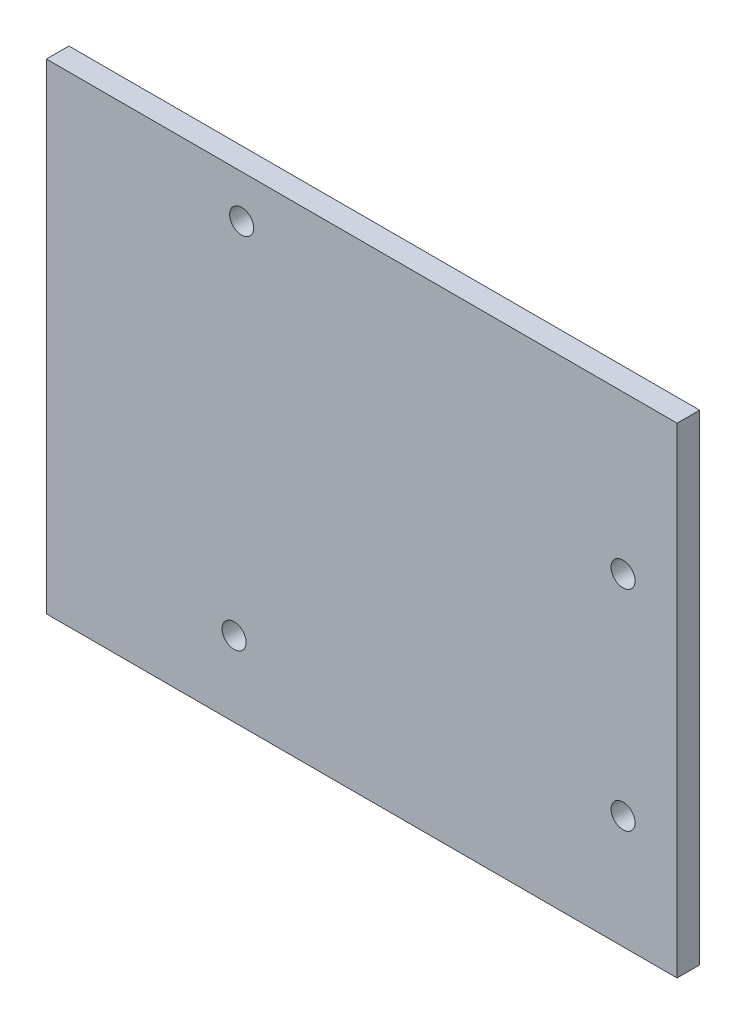
ISO-10303-21;
HEADER;
FILE_DESCRIPTION(('STEP AP214'),'2;1');
FILE_NAME('part.step','',(''),(''),'','','');
FILE_SCHEMA(('AUTOMOTIVE_DESIGN { 1 0 10303 214 1 1 1 1 }'));
ENDSEC;
DATA;
#1=APPLICATION_CONTEXT('core data for automotive mechanical design processes');
#2=APPLICATION_PROTOCOL_DEFINITION('international standard','automotive_design',2000,#1);
#3=PRODUCT_CONTEXT('',#1,'mechanical');
#4=PRODUCT('Part','Part','',(#3));
#5=PRODUCT_RELATED_PRODUCT_CATEGORY('part','',(#4));
#6=PRODUCT_DEFINITION_FORMATION('','',#4);
#7=PRODUCT_DEFINITION_CONTEXT('part definition',#1,'design');
#8=PRODUCT_DEFINITION('design','',#6,#7);
#9=PRODUCT_DEFINITION_SHAPE('','',#8);
#10=(LENGTH_UNIT() NAMED_UNIT(*) SI_UNIT(.MILLI.,.METRE.));
#11=(NAMED_UNIT(*) PLANE_ANGLE_UNIT() SI_UNIT($,.RADIAN.));
#12=(NAMED_UNIT(*) SI_UNIT($,.STERADIAN.) SOLID_ANGLE_UNIT());
#13=UNCERTAINTY_MEASURE_WITH_UNIT(LENGTH_MEASURE(1.E-05),#10,'distance_accuracy_value','');
#14=(GEOMETRIC_REPRESENTATION_CONTEXT(3) GLOBAL_UNCERTAINTY_ASSIGNED_CONTEXT((#13)) GLOBAL_UNIT_ASSIGNED_CONTEXT((#10,
#11,#12)) REPRESENTATION_CONTEXT('',''));
#15=CARTESIAN_POINT('',(0.,0.,0.));
#16=DIRECTION('',(0.,0.,1.));
#17=DIRECTION('',(1.,0.,0.));
#18=AXIS2_PLACEMENT_3D('',#15,#16,#17);
#19=CARTESIAN_POINT('',(-50.,50.,3.));
#20=DIRECTION('',(1.,0.,0.));
#21=DIRECTION('',(0.,1.,0.));
#22=AXIS2_PLACEMENT_3D('',#19,#20,#21);
#23=PLANE('',#22);
#24=DIRECTION('',(0.,-1.,0.));
#25=VECTOR('',#24,1.);
#26=CARTESIAN_POINT('',(-50.,50.,3.));
#27=LINE('',#26,#25);
#28=CARTESIAN_POINT('',(-50.,14.,3.));
#29=VERTEX_POINT('',#28);
#30=CARTESIAN_POINT('',(-50.,-50.,3.));
#31=VERTEX_POINT('',#30);
#32=EDGE_CURVE('E66',#29,#31,#27,.T.);
#33=ORIENTED_EDGE('',*,*,#32,.F.);
#34=DIRECTION('',(0.,0.,1.));
#35=VECTOR('',#34,1.);
#36=CARTESIAN_POINT('',(-50.,14.,0.));
#37=LINE('',#36,#35);
#38=CARTESIAN_POINT('',(-50.,14.,0.));
#39=VERTEX_POINT('',#38);
#40=EDGE_CURVE('E88',#39,#29,#37,.T.);
#41=ORIENTED_EDGE('',*,*,#40,.F.);
#42=DIRECTION('',(0.,-1.,0.));
#43=VECTOR('',#42,1.);
#44=CARTESIAN_POINT('',(-50.,50.,0.));
#45=LINE('',#44,#43);
#46=CARTESIAN_POINT('',(-50.,-50.,0.));
#47=VERTEX_POINT('',#46);
#48=EDGE_CURVE('E96',#39,#47,#45,.T.);
#49=ORIENTED_EDGE('',*,*,#48,.T.);
#50=DIRECTION('',(0.,0.,-1.));
#51=VECTOR('',#50,1.);
#52=CARTESIAN_POINT('',(-50.,-50.,3.));
#53=LINE('',#52,#51);
#54=EDGE_CURVE('E11',#31,#47,#53,.T.);
#55=ORIENTED_EDGE('',*,*,#54,.F.);
#56=EDGE_LOOP('',(#33,#41,#49,#55));
#57=FACE_BOUND('',#56,.T.);
#58=ADVANCED_FACE('F40',(#57),#23,.F.);
#59=CARTESIAN_POINT('',(-50.,-50.,3.));
#60=DIRECTION('',(0.,1.,0.));
#61=DIRECTION('',(-1.,0.,0.));
#62=AXIS2_PLACEMENT_3D('',#59,#60,#61);
#63=PLANE('',#62);
#64=DIRECTION('',(1.,0.,0.));
#65=VECTOR('',#64,1.);
#66=CARTESIAN_POINT('',(-50.,-50.,0.));
#67=LINE('',#66,#65);
#68=CARTESIAN_POINT('',(34.,-50.,0.));
#69=VERTEX_POINT('',#68);
#70=EDGE_CURVE('E102',#47,#69,#67,.T.);
#71=ORIENTED_EDGE('',*,*,#70,.T.);
#72=DIRECTION('',(0.,0.,1.));
#73=VECTOR('',#72,1.);
#74=CARTESIAN_POINT('',(34.,-50.,0.));
#75=LINE('',#74,#73);
#76=CARTESIAN_POINT('',(34.,-50.,3.));
#77=VERTEX_POINT('',#76);
#78=EDGE_CURVE('E188',#69,#77,#75,.T.);
#79=ORIENTED_EDGE('',*,*,#78,.T.);
#80=DIRECTION('',(1.,0.,0.));
#81=VECTOR('',#80,1.);
#82=CARTESIAN_POINT('',(-50.,-50.,3.));
#83=LINE('',#82,#81);
#84=EDGE_CURVE('E49',#31,#77,#83,.T.);
#85=ORIENTED_EDGE('',*,*,#84,.F.);
#86=ORIENTED_EDGE('',*,*,#54,.T.);
#87=EDGE_LOOP('',(#71,#79,#85,#86));
#88=FACE_BOUND('',#87,.T.);
#89=ADVANCED_FACE('F145',(#88),#63,.F.);
#90=CARTESIAN_POINT('',(0.,0.,3.));
#91=DIRECTION('',(0.,0.,1.));
#92=DIRECTION('',(1.,0.,0.));
#93=AXIS2_PLACEMENT_3D('',#90,#91,#92);
#94=PLANE('',#93);
#95=DIRECTION('',(0.,-1.,0.));
#96=VECTOR('',#95,1.);
#97=CARTESIAN_POINT('',(34.,14.,3.));
#98=LINE('',#97,#96);
#99=CARTESIAN_POINT('',(34.,14.,3.));
#100=VERTEX_POINT('',#99);
#101=EDGE_CURVE('E93',#100,#77,#98,.T.);
#102=ORIENTED_EDGE('',*,*,#101,.F.);
#103=DIRECTION('',(1.,0.,0.));
#104=VECTOR('',#103,1.);
#105=CARTESIAN_POINT('',(-50.,14.,3.));
#106=LINE('',#105,#104);
#107=EDGE_CURVE('E205',#29,#100,#106,.T.);
#108=ORIENTED_EDGE('',*,*,#107,.F.);
#109=ORIENTED_EDGE('',*,*,#32,.T.);
#110=ORIENTED_EDGE('',*,*,#84,.T.);
#111=EDGE_LOOP('',(#102,#108,#109,#110));
#112=FACE_BOUND('',#111,.T.);
#113=CARTESIAN_POINT('',(-23.9925225828861,8.28949149922791,3.));
#114=DIRECTION('',(0.,0.,1.));
#115=DIRECTION('',(1.,0.,0.));
#116=AXIS2_PLACEMENT_3D('',#113,#114,#115);
#117=CIRCLE('',#116,1.6);
#118=CARTESIAN_POINT('',(-22.3925225828861,8.28949149922791,3.));
#119=VERTEX_POINT('',#118);
#120=EDGE_CURVE('E180',#119,#119,#117,.T.);
#121=ORIENTED_EDGE('',*,*,#120,.F.);
#122=EDGE_LOOP('',(#121));
#123=FACE_BOUND('',#122,.T.);
#124=CARTESIAN_POINT('',(-25.,-40.,3.));
#125=DIRECTION('',(0.,0.,1.));
#126=DIRECTION('',(1.,0.,0.));
#127=AXIS2_PLACEMENT_3D('',#124,#125,#126);
#128=CIRCLE('',#127,1.6);
#129=CARTESIAN_POINT('',(-23.4,-40.,3.));
#130=VERTEX_POINT('',#129);
#131=EDGE_CURVE('E177',#130,#130,#128,.T.);
#132=ORIENTED_EDGE('',*,*,#131,.F.);
#133=EDGE_LOOP('',(#132));
#134=FACE_BOUND('',#133,.T.);
#135=CARTESIAN_POINT('',(26.8074774171139,-7.00000000000002,3.));
#136=DIRECTION('',(0.,0.,1.));
#137=DIRECTION('',(1.,0.,0.));
#138=AXIS2_PLACEMENT_3D('',#135,#136,#137);
#139=CIRCLE('',#138,1.6);
#140=CARTESIAN_POINT('',(28.4074774171139,-7.00000000000002,3.));
#141=VERTEX_POINT('',#140);
#142=EDGE_CURVE('E173',#141,#141,#139,.T.);
#143=ORIENTED_EDGE('',*,*,#142,.F.);
#144=EDGE_LOOP('',(#143));
#145=FACE_BOUND('',#144,.T.);
#146=CARTESIAN_POINT('',(26.8074774171139,-34.9,3.));
#147=DIRECTION('',(0.,0.,1.));
#148=DIRECTION('',(1.,0.,0.));
#149=AXIS2_PLACEMENT_3D('',#146,#147,#148);
#150=CIRCLE('',#149,1.6);
#151=CARTESIAN_POINT('',(28.4074774171139,-34.9,3.));
#152=VERTEX_POINT('',#151);
#153=EDGE_CURVE('E118',#152,#152,#150,.T.);
#154=ORIENTED_EDGE('',*,*,#153,.F.);
#155=EDGE_LOOP('',(#154));
#156=FACE_BOUND('',#155,.T.);
#157=ADVANCED_FACE('F150',(#112,#123,#134,#145,#156),#94,.T.);
#158=CARTESIAN_POINT('',(0.,0.,0.));
#159=DIRECTION('',(0.,0.,1.));
#160=DIRECTION('',(1.,0.,0.));
#161=AXIS2_PLACEMENT_3D('',#158,#159,#160);
#162=PLANE('',#161);
#163=CARTESIAN_POINT('',(-23.9925225828861,8.28949149922791,0.));
#164=DIRECTION('',(0.,0.,1.));
#165=DIRECTION('',(1.,0.,0.));
#166=AXIS2_PLACEMENT_3D('',#163,#164,#165);
#167=CIRCLE('',#166,1.6);
#168=CARTESIAN_POINT('',(-22.3925225828861,8.28949149922791,0.));
#169=VERTEX_POINT('',#168);
#170=EDGE_CURVE('E43',#169,#169,#167,.T.);
#171=ORIENTED_EDGE('',*,*,#170,.T.);
#172=EDGE_LOOP('',(#171));
#173=FACE_BOUND('',#172,.T.);
#174=CARTESIAN_POINT('',(-25.,-40.,0.));
#175=DIRECTION('',(0.,0.,1.));
#176=DIRECTION('',(1.,0.,0.));
#177=AXIS2_PLACEMENT_3D('',#174,#175,#176);
#178=CIRCLE('',#177,1.6);
#179=CARTESIAN_POINT('',(-23.4,-40.,0.));
#180=VERTEX_POINT('',#179);
#181=EDGE_CURVE('E109',#180,#180,#178,.T.);
#182=ORIENTED_EDGE('',*,*,#181,.T.);
#183=EDGE_LOOP('',(#182));
#184=FACE_BOUND('',#183,.T.);
#185=CARTESIAN_POINT('',(26.8074774171139,-7.00000000000002,0.));
#186=DIRECTION('',(0.,0.,1.));
#187=DIRECTION('',(1.,0.,0.));
#188=AXIS2_PLACEMENT_3D('',#185,#186,#187);
#189=CIRCLE('',#188,1.6);
#190=CARTESIAN_POINT('',(28.4074774171139,-7.00000000000002,0.));
#191=VERTEX_POINT('',#190);
#192=EDGE_CURVE('E117',#191,#191,#189,.T.);
#193=ORIENTED_EDGE('',*,*,#192,.T.);
#194=EDGE_LOOP('',(#193));
#195=FACE_BOUND('',#194,.T.);
#196=CARTESIAN_POINT('',(26.8074774171139,-34.9,0.));
#197=DIRECTION('',(0.,0.,1.));
#198=DIRECTION('',(1.,0.,0.));
#199=AXIS2_PLACEMENT_3D('',#196,#197,#198);
#200=CIRCLE('',#199,1.6);
#201=CARTESIAN_POINT('',(28.4074774171139,-34.9,0.));
#202=VERTEX_POINT('',#201);
#203=EDGE_CURVE('E113',#202,#202,#200,.T.);
#204=ORIENTED_EDGE('',*,*,#203,.T.);
#205=EDGE_LOOP('',(#204));
#206=FACE_BOUND('',#205,.T.);
#207=DIRECTION('',(1.,0.,0.));
#208=VECTOR('',#207,1.);
#209=CARTESIAN_POINT('',(-50.,14.,0.));
#210=LINE('',#209,#208);
#211=CARTESIAN_POINT('',(34.,14.,0.));
#212=VERTEX_POINT('',#211);
#213=EDGE_CURVE('E84',#39,#212,#210,.T.);
#214=ORIENTED_EDGE('',*,*,#213,.T.);
#215=DIRECTION('',(0.,-1.,0.));
#216=VECTOR('',#215,1.);
#217=CARTESIAN_POINT('',(34.,14.,0.));
#218=LINE('',#217,#216);
#219=EDGE_CURVE('E57',#212,#69,#218,.T.);
#220=ORIENTED_EDGE('',*,*,#219,.T.);
#221=ORIENTED_EDGE('',*,*,#70,.F.);
#222=ORIENTED_EDGE('',*,*,#48,.F.);
#223=EDGE_LOOP('',(#214,#220,#221,#222));
#224=FACE_BOUND('',#223,.T.);
#225=ADVANCED_FACE('F100',(#173,#184,#195,#206,#224),#162,.F.);
#226=CARTESIAN_POINT('',(26.8074774171139,-34.9,-56.));
#227=DIRECTION('',(0.,0.,1.));
#228=DIRECTION('',(1.,0.,0.));
#229=AXIS2_PLACEMENT_3D('',#226,#227,#228);
#230=CYLINDRICAL_SURFACE('',#229,1.6);
#231=ORIENTED_EDGE('',*,*,#153,.T.);
#232=EDGE_LOOP('',(#231));
#233=FACE_BOUND('',#232,.T.);
#234=ORIENTED_EDGE('',*,*,#203,.F.);
#235=EDGE_LOOP('',(#234));
#236=FACE_BOUND('',#235,.T.);
#237=ADVANCED_FACE('F140',(#233,#236),#230,.F.);
#238=CARTESIAN_POINT('',(26.8074774171139,-7.00000000000002,-56.));
#239=DIRECTION('',(0.,0.,1.));
#240=DIRECTION('',(1.,0.,0.));
#241=AXIS2_PLACEMENT_3D('',#238,#239,#240);
#242=CYLINDRICAL_SURFACE('',#241,1.6);
#243=ORIENTED_EDGE('',*,*,#142,.T.);
#244=EDGE_LOOP('',(#243));
#245=FACE_BOUND('',#244,.T.);
#246=ORIENTED_EDGE('',*,*,#192,.F.);
#247=EDGE_LOOP('',(#246));
#248=FACE_BOUND('',#247,.T.);
#249=ADVANCED_FACE('F130',(#245,#248),#242,.F.);
#250=CARTESIAN_POINT('',(-25.,-40.,-56.));
#251=DIRECTION('',(0.,0.,1.));
#252=DIRECTION('',(1.,0.,0.));
#253=AXIS2_PLACEMENT_3D('',#250,#251,#252);
#254=CYLINDRICAL_SURFACE('',#253,1.6);
#255=ORIENTED_EDGE('',*,*,#131,.T.);
#256=EDGE_LOOP('',(#255));
#257=FACE_BOUND('',#256,.T.);
#258=ORIENTED_EDGE('',*,*,#181,.F.);
#259=EDGE_LOOP('',(#258));
#260=FACE_BOUND('',#259,.T.);
#261=ADVANCED_FACE('F127',(#257,#260),#254,.F.);
#262=CARTESIAN_POINT('',(-23.9925225828861,8.28949149922791,-56.));
#263=DIRECTION('',(0.,0.,1.));
#264=DIRECTION('',(1.,0.,0.));
#265=AXIS2_PLACEMENT_3D('',#262,#263,#264);
#266=CYLINDRICAL_SURFACE('',#265,1.6);
#267=ORIENTED_EDGE('',*,*,#120,.T.);
#268=EDGE_LOOP('',(#267));
#269=FACE_BOUND('',#268,.T.);
#270=ORIENTED_EDGE('',*,*,#170,.F.);
#271=EDGE_LOOP('',(#270));
#272=FACE_BOUND('',#271,.T.);
#273=ADVANCED_FACE('F129',(#269,#272),#266,.F.);
#274=CARTESIAN_POINT('',(34.,14.,0.));
#275=DIRECTION('',(-1.,0.,0.));
#276=DIRECTION('',(0.,-1.,0.));
#277=AXIS2_PLACEMENT_3D('',#274,#275,#276);
#278=PLANE('',#277);
#279=ORIENTED_EDGE('',*,*,#101,.T.);
#280=ORIENTED_EDGE('',*,*,#78,.F.);
#281=ORIENTED_EDGE('',*,*,#219,.F.);
#282=DIRECTION('',(0.,0.,1.));
#283=VECTOR('',#282,1.);
#284=CARTESIAN_POINT('',(34.,14.,0.));
#285=LINE('',#284,#283);
#286=EDGE_CURVE('E89',#212,#100,#285,.T.);
#287=ORIENTED_EDGE('',*,*,#286,.T.);
#288=EDGE_LOOP('',(#279,#280,#281,#287));
#289=FACE_BOUND('',#288,.T.);
#290=ADVANCED_FACE('F137',(#289),#278,.F.);
#291=CARTESIAN_POINT('',(-50.,14.,0.));
#292=DIRECTION('',(0.,-1.,0.));
#293=DIRECTION('',(0.,0.,-1.));
#294=AXIS2_PLACEMENT_3D('',#291,#292,#293);
#295=PLANE('',#294);
#296=ORIENTED_EDGE('',*,*,#107,.T.);
#297=ORIENTED_EDGE('',*,*,#286,.F.);
#298=ORIENTED_EDGE('',*,*,#213,.F.);
#299=ORIENTED_EDGE('',*,*,#40,.T.);
#300=EDGE_LOOP('',(#296,#297,#298,#299));
#301=FACE_BOUND('',#300,.T.);
#302=ADVANCED_FACE('F87',(#301),#295,.F.);
#303=CLOSED_SHELL('',(#58,#89,#157,#225,#237,#249,#261,#273,#290,#302));
#304=MANIFOLD_SOLID_BREP('B2',#303);
#305=ADVANCED_BREP_SHAPE_REPRESENTATION('',(#18,#304),#14);
#306=SHAPE_DEFINITION_REPRESENTATION(#9,#305);
ENDSEC;
END-ISO-10303-21;
